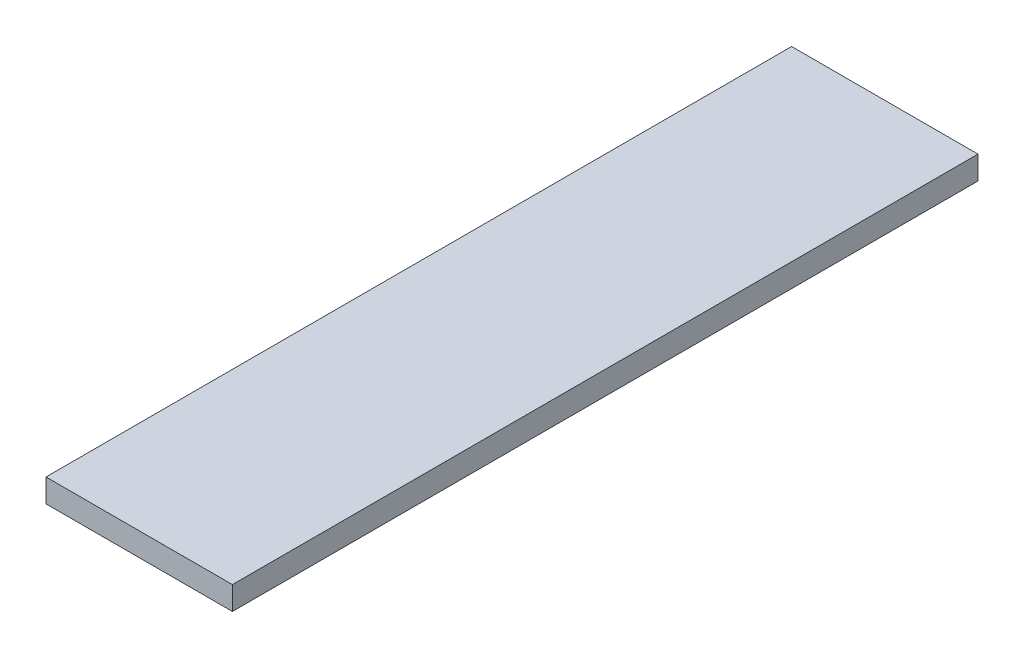
ISO-10303-21;
HEADER;
FILE_DESCRIPTION(('STEP AP214'),'2;1');
FILE_NAME('part.step','',(''),(''),'','','');
FILE_SCHEMA(('AUTOMOTIVE_DESIGN { 1 0 10303 214 1 1 1 1 }'));
ENDSEC;
DATA;
#1=APPLICATION_CONTEXT('core data for automotive mechanical design processes');
#2=APPLICATION_PROTOCOL_DEFINITION('international standard','automotive_design',2000,#1);
#3=PRODUCT_CONTEXT('',#1,'mechanical');
#4=PRODUCT('Part','Part','',(#3));
#5=PRODUCT_RELATED_PRODUCT_CATEGORY('part','',(#4));
#6=PRODUCT_DEFINITION_FORMATION('','',#4);
#7=PRODUCT_DEFINITION_CONTEXT('part definition',#1,'design');
#8=PRODUCT_DEFINITION('design','',#6,#7);
#9=PRODUCT_DEFINITION_SHAPE('','',#8);
#10=(LENGTH_UNIT() NAMED_UNIT(*) SI_UNIT(.MILLI.,.METRE.));
#11=(NAMED_UNIT(*) PLANE_ANGLE_UNIT() SI_UNIT($,.RADIAN.));
#12=(NAMED_UNIT(*) SI_UNIT($,.STERADIAN.) SOLID_ANGLE_UNIT());
#13=UNCERTAINTY_MEASURE_WITH_UNIT(LENGTH_MEASURE(1.E-05),#10,'distance_accuracy_value','');
#14=(GEOMETRIC_REPRESENTATION_CONTEXT(3) GLOBAL_UNCERTAINTY_ASSIGNED_CONTEXT((#13)) GLOBAL_UNIT_ASSIGNED_CONTEXT((#10,
#11,#12)) REPRESENTATION_CONTEXT('',''));
#15=CARTESIAN_POINT('',(0.,0.,0.));
#16=DIRECTION('',(0.,0.,1.));
#17=DIRECTION('',(1.,0.,0.));
#18=AXIS2_PLACEMENT_3D('',#15,#16,#17);
#19=CARTESIAN_POINT('',(0.,3.175,0.));
#20=DIRECTION('',(1.,0.,0.));
#21=DIRECTION('',(0.,0.,-1.));
#22=AXIS2_PLACEMENT_3D('',#19,#20,#21);
#23=PLANE('',#22);
#24=DIRECTION('',(0.,0.,1.));
#25=VECTOR('',#24,1.);
#26=CARTESIAN_POINT('',(0.,0.,0.));
#27=LINE('',#26,#25);
#28=CARTESIAN_POINT('',(0.,0.,-101.6));
#29=VERTEX_POINT('',#28);
#30=CARTESIAN_POINT('',(0.,0.,0.));
#31=VERTEX_POINT('',#30);
#32=EDGE_CURVE('E94',#29,#31,#27,.T.);
#33=ORIENTED_EDGE('',*,*,#32,.T.);
#34=DIRECTION('',(0.,-1.,0.));
#35=VECTOR('',#34,1.);
#36=CARTESIAN_POINT('',(0.,3.175,0.));
#37=LINE('',#36,#35);
#38=CARTESIAN_POINT('',(0.,3.175,0.));
#39=VERTEX_POINT('',#38);
#40=EDGE_CURVE('E11',#39,#31,#37,.T.);
#41=ORIENTED_EDGE('',*,*,#40,.F.);
#42=DIRECTION('',(0.,0.,1.));
#43=VECTOR('',#42,1.);
#44=CARTESIAN_POINT('',(0.,3.175,0.));
#45=LINE('',#44,#43);
#46=CARTESIAN_POINT('',(0.,3.175,-101.6));
#47=VERTEX_POINT('',#46);
#48=EDGE_CURVE('E82',#47,#39,#45,.T.);
#49=ORIENTED_EDGE('',*,*,#48,.F.);
#50=DIRECTION('',(0.,-1.,0.));
#51=VECTOR('',#50,1.);
#52=CARTESIAN_POINT('',(0.,3.175,-101.6));
#53=LINE('',#52,#51);
#54=EDGE_CURVE('E90',#47,#29,#53,.T.);
#55=ORIENTED_EDGE('',*,*,#54,.T.);
#56=EDGE_LOOP('',(#33,#41,#49,#55));
#57=FACE_BOUND('',#56,.T.);
#58=ADVANCED_FACE('F31',(#57),#23,.F.);
#59=CARTESIAN_POINT('',(0.,3.175,0.));
#60=DIRECTION('',(0.,0.,-1.));
#61=DIRECTION('',(-1.,0.,0.));
#62=AXIS2_PLACEMENT_3D('',#59,#60,#61);
#63=PLANE('',#62);
#64=DIRECTION('',(1.,0.,0.));
#65=VECTOR('',#64,1.);
#66=CARTESIAN_POINT('',(0.,0.,0.));
#67=LINE('',#66,#65);
#68=CARTESIAN_POINT('',(25.4,0.,0.));
#69=VERTEX_POINT('',#68);
#70=EDGE_CURVE('E86',#31,#69,#67,.T.);
#71=ORIENTED_EDGE('',*,*,#70,.T.);
#72=DIRECTION('',(0.,-1.,0.));
#73=VECTOR('',#72,1.);
#74=CARTESIAN_POINT('',(25.4,3.175,0.));
#75=LINE('',#74,#73);
#76=CARTESIAN_POINT('',(25.4,3.175,0.));
#77=VERTEX_POINT('',#76);
#78=EDGE_CURVE('E39',#77,#69,#75,.T.);
#79=ORIENTED_EDGE('',*,*,#78,.F.);
#80=DIRECTION('',(1.,0.,0.));
#81=VECTOR('',#80,1.);
#82=CARTESIAN_POINT('',(0.,3.175,0.));
#83=LINE('',#82,#81);
#84=EDGE_CURVE('E77',#39,#77,#83,.T.);
#85=ORIENTED_EDGE('',*,*,#84,.F.);
#86=ORIENTED_EDGE('',*,*,#40,.T.);
#87=EDGE_LOOP('',(#71,#79,#85,#86));
#88=FACE_BOUND('',#87,.T.);
#89=ADVANCED_FACE('F85',(#88),#63,.F.);
#90=CARTESIAN_POINT('',(25.4,3.175,0.));
#91=DIRECTION('',(-1.,0.,0.));
#92=DIRECTION('',(0.,0.,1.));
#93=AXIS2_PLACEMENT_3D('',#90,#91,#92);
#94=PLANE('',#93);
#95=DIRECTION('',(0.,0.,-1.));
#96=VECTOR('',#95,1.);
#97=CARTESIAN_POINT('',(25.4,0.,0.));
#98=LINE('',#97,#96);
#99=CARTESIAN_POINT('',(25.4,0.,-101.6));
#100=VERTEX_POINT('',#99);
#101=EDGE_CURVE('E64',#69,#100,#98,.T.);
#102=ORIENTED_EDGE('',*,*,#101,.T.);
#103=DIRECTION('',(0.,-1.,0.));
#104=VECTOR('',#103,1.);
#105=CARTESIAN_POINT('',(25.4,3.175,-101.6));
#106=LINE('',#105,#104);
#107=CARTESIAN_POINT('',(25.4,3.175,-101.6));
#108=VERTEX_POINT('',#107);
#109=EDGE_CURVE('E87',#108,#100,#106,.T.);
#110=ORIENTED_EDGE('',*,*,#109,.F.);
#111=DIRECTION('',(0.,0.,-1.));
#112=VECTOR('',#111,1.);
#113=CARTESIAN_POINT('',(25.4,3.175,0.));
#114=LINE('',#113,#112);
#115=EDGE_CURVE('E80',#77,#108,#114,.T.);
#116=ORIENTED_EDGE('',*,*,#115,.F.);
#117=ORIENTED_EDGE('',*,*,#78,.T.);
#118=EDGE_LOOP('',(#102,#110,#116,#117));
#119=FACE_BOUND('',#118,.T.);
#120=ADVANCED_FACE('F88',(#119),#94,.F.);
#121=CARTESIAN_POINT('',(0.,3.175,-101.6));
#122=DIRECTION('',(0.,0.,1.));
#123=DIRECTION('',(1.,0.,0.));
#124=AXIS2_PLACEMENT_3D('',#121,#122,#123);
#125=PLANE('',#124);
#126=DIRECTION('',(-1.,0.,0.));
#127=VECTOR('',#126,1.);
#128=CARTESIAN_POINT('',(0.,0.,-101.6));
#129=LINE('',#128,#127);
#130=EDGE_CURVE('E70',#100,#29,#129,.T.);
#131=ORIENTED_EDGE('',*,*,#130,.T.);
#132=ORIENTED_EDGE('',*,*,#54,.F.);
#133=DIRECTION('',(-1.,0.,0.));
#134=VECTOR('',#133,1.);
#135=CARTESIAN_POINT('',(0.,3.175,-101.6));
#136=LINE('',#135,#134);
#137=EDGE_CURVE('E47',#108,#47,#136,.T.);
#138=ORIENTED_EDGE('',*,*,#137,.F.);
#139=ORIENTED_EDGE('',*,*,#109,.T.);
#140=EDGE_LOOP('',(#131,#132,#138,#139));
#141=FACE_BOUND('',#140,.T.);
#142=ADVANCED_FACE('F101',(#141),#125,.F.);
#143=CARTESIAN_POINT('',(0.,3.175,-101.6));
#144=DIRECTION('',(0.,-1.,0.));
#145=DIRECTION('',(0.,0.,-1.));
#146=AXIS2_PLACEMENT_3D('',#143,#144,#145);
#147=PLANE('',#146);
#148=ORIENTED_EDGE('',*,*,#48,.T.);
#149=ORIENTED_EDGE('',*,*,#84,.T.);
#150=ORIENTED_EDGE('',*,*,#115,.T.);
#151=ORIENTED_EDGE('',*,*,#137,.T.);
#152=EDGE_LOOP('',(#148,#149,#150,#151));
#153=FACE_BOUND('',#152,.T.);
#154=ADVANCED_FACE('F78',(#153),#147,.F.);
#155=CARTESIAN_POINT('',(0.,0.,-101.6));
#156=DIRECTION('',(0.,-1.,0.));
#157=DIRECTION('',(0.,0.,-1.));
#158=AXIS2_PLACEMENT_3D('',#155,#156,#157);
#159=PLANE('',#158);
#160=ORIENTED_EDGE('',*,*,#32,.F.);
#161=ORIENTED_EDGE('',*,*,#130,.F.);
#162=ORIENTED_EDGE('',*,*,#101,.F.);
#163=ORIENTED_EDGE('',*,*,#70,.F.);
#164=EDGE_LOOP('',(#160,#161,#162,#163));
#165=FACE_BOUND('',#164,.T.);
#166=ADVANCED_FACE('F104',(#165),#159,.T.);
#167=CLOSED_SHELL('',(#58,#89,#120,#142,#154,#166));
#168=MANIFOLD_SOLID_BREP('B2',#167);
#169=ADVANCED_BREP_SHAPE_REPRESENTATION('',(#18,#168),#14);
#170=SHAPE_DEFINITION_REPRESENTATION(#9,#169);
ENDSEC;
END-ISO-10303-21;
